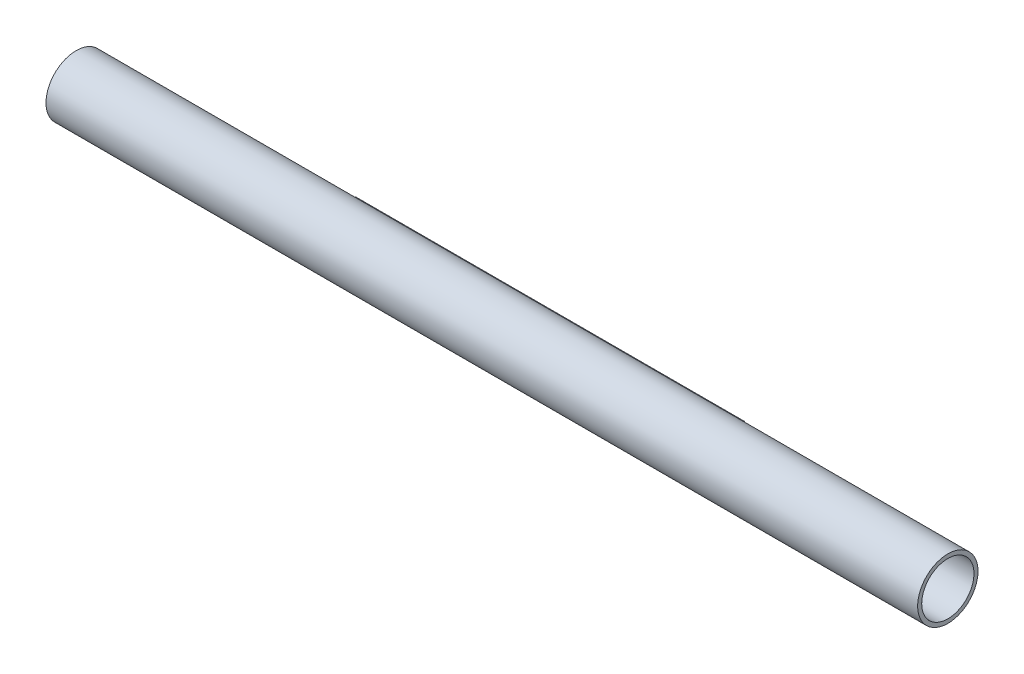
ISO-10303-21;
HEADER;
FILE_DESCRIPTION(('STEP AP214'),'2;1');
FILE_NAME('part.step','',(''),(''),'','','');
FILE_SCHEMA(('AUTOMOTIVE_DESIGN { 1 0 10303 214 1 1 1 1 }'));
ENDSEC;
DATA;
#1=APPLICATION_CONTEXT('core data for automotive mechanical design processes');
#2=APPLICATION_PROTOCOL_DEFINITION('international standard','automotive_design',2000,#1);
#3=PRODUCT_CONTEXT('',#1,'mechanical');
#4=PRODUCT('Part','Part','',(#3));
#5=PRODUCT_RELATED_PRODUCT_CATEGORY('part','',(#4));
#6=PRODUCT_DEFINITION_FORMATION('','',#4);
#7=PRODUCT_DEFINITION_CONTEXT('part definition',#1,'design');
#8=PRODUCT_DEFINITION('design','',#6,#7);
#9=PRODUCT_DEFINITION_SHAPE('','',#8);
#10=(LENGTH_UNIT() NAMED_UNIT(*) SI_UNIT(.MILLI.,.METRE.));
#11=(NAMED_UNIT(*) PLANE_ANGLE_UNIT() SI_UNIT($,.RADIAN.));
#12=(NAMED_UNIT(*) SI_UNIT($,.STERADIAN.) SOLID_ANGLE_UNIT());
#13=UNCERTAINTY_MEASURE_WITH_UNIT(LENGTH_MEASURE(1.E-05),#10,'distance_accuracy_value','');
#14=(GEOMETRIC_REPRESENTATION_CONTEXT(3) GLOBAL_UNCERTAINTY_ASSIGNED_CONTEXT((#13)) GLOBAL_UNIT_ASSIGNED_CONTEXT((#10,
#11,#12)) REPRESENTATION_CONTEXT('',''));
#15=CARTESIAN_POINT('',(0.,0.,0.));
#16=DIRECTION('',(0.,0.,1.));
#17=DIRECTION('',(1.,0.,0.));
#18=AXIS2_PLACEMENT_3D('',#15,#16,#17);
#19=CARTESIAN_POINT('',(-491.49,0.,0.));
#20=DIRECTION('',(1.,0.,0.));
#21=DIRECTION('',(0.,0.,-1.));
#22=AXIS2_PLACEMENT_3D('',#19,#20,#21);
#23=PLANE('',#22);
#24=CARTESIAN_POINT('',(-491.49,0.,0.));
#25=DIRECTION('',(-1.,0.,0.));
#26=DIRECTION('',(0.,0.,1.));
#27=AXIS2_PLACEMENT_3D('',#24,#25,#26);
#28=CIRCLE('',#27,38.1);
#29=CARTESIAN_POINT('',(-491.49,6.35,-37.5671066226826));
#30=VERTEX_POINT('',#29);
#31=CARTESIAN_POINT('',(-491.49,-6.35,-37.5671066226826));
#32=VERTEX_POINT('',#31);
#33=EDGE_CURVE('E91',#30,#32,#28,.T.);
#34=ORIENTED_EDGE('',*,*,#33,.F.);
#35=DIRECTION('',(0.,0.,-1.));
#36=VECTOR('',#35,1.);
#37=CARTESIAN_POINT('',(-491.49,6.35,0.));
#38=LINE('',#37,#36);
#39=CARTESIAN_POINT('',(-491.49,6.35,-48.26));
#40=VERTEX_POINT('',#39);
#41=EDGE_CURVE('E65',#30,#40,#38,.T.);
#42=ORIENTED_EDGE('',*,*,#41,.T.);
#43=DIRECTION('',(0.,1.,0.));
#44=VECTOR('',#43,1.);
#45=CARTESIAN_POINT('',(-491.49,0.,-48.26));
#46=LINE('',#45,#44);
#47=CARTESIAN_POINT('',(-491.49,-6.35,-48.26));
#48=VERTEX_POINT('',#47);
#49=EDGE_CURVE('E110',#48,#40,#46,.T.);
#50=ORIENTED_EDGE('',*,*,#49,.F.);
#51=DIRECTION('',(0.,0.,-1.));
#52=VECTOR('',#51,1.);
#53=CARTESIAN_POINT('',(-491.49,-6.35,0.));
#54=LINE('',#53,#52);
#55=EDGE_CURVE('E98',#32,#48,#54,.T.);
#56=ORIENTED_EDGE('',*,*,#55,.F.);
#57=EDGE_LOOP('',(#34,#42,#50,#56));
#58=FACE_BOUND('',#57,.T.);
#59=ADVANCED_FACE('F45',(#58),#23,.F.);
#60=CARTESIAN_POINT('',(-491.49,0.,0.));
#61=DIRECTION('',(1.,0.,0.));
#62=DIRECTION('',(0.,0.,-1.));
#63=AXIS2_PLACEMENT_3D('',#60,#61,#62);
#64=CYLINDRICAL_SURFACE('',#63,38.1);
#65=DIRECTION('',(1.,0.,0.));
#66=VECTOR('',#65,1.);
#67=CARTESIAN_POINT('',(-491.49,-6.35,-37.5671066226826));
#68=LINE('',#67,#66);
#69=CARTESIAN_POINT('',(0.,-6.35,-37.5671066226826));
#70=VERTEX_POINT('',#69);
#71=EDGE_CURVE('E49',#32,#70,#68,.T.);
#72=ORIENTED_EDGE('',*,*,#71,.T.);
#73=CARTESIAN_POINT('',(0.,0.,0.));
#74=DIRECTION('',(1.,0.,0.));
#75=DIRECTION('',(0.,0.,-1.));
#76=AXIS2_PLACEMENT_3D('',#73,#74,#75);
#77=CIRCLE('',#76,38.1);
#78=CARTESIAN_POINT('',(0.,6.35,-37.5671066226826));
#79=VERTEX_POINT('',#78);
#80=EDGE_CURVE('E11',#70,#79,#77,.T.);
#81=ORIENTED_EDGE('',*,*,#80,.T.);
#82=DIRECTION('',(1.,0.,0.));
#83=VECTOR('',#82,1.);
#84=CARTESIAN_POINT('',(-491.49,6.35,-37.5671066226826));
#85=LINE('',#84,#83);
#86=EDGE_CURVE('E56',#30,#79,#85,.T.);
#87=ORIENTED_EDGE('',*,*,#86,.F.);
#88=ORIENTED_EDGE('',*,*,#33,.T.);
#89=EDGE_LOOP('',(#72,#81,#87,#88));
#90=FACE_BOUND('',#89,.T.);
#91=CARTESIAN_POINT('',(304.8,0.,0.));
#92=DIRECTION('',(1.,0.,0.));
#93=DIRECTION('',(0.,0.,-1.));
#94=AXIS2_PLACEMENT_3D('',#91,#92,#93);
#95=CIRCLE('',#94,38.1);
#96=CARTESIAN_POINT('',(304.8,0.,-38.1));
#97=VERTEX_POINT('',#96);
#98=EDGE_CURVE('E122',#97,#97,#95,.T.);
#99=ORIENTED_EDGE('',*,*,#98,.F.);
#100=EDGE_LOOP('',(#99));
#101=FACE_BOUND('',#100,.T.);
#102=CARTESIAN_POINT('',(-796.29,0.,0.));
#103=DIRECTION('',(-1.,0.,0.));
#104=DIRECTION('',(0.,0.,1.));
#105=AXIS2_PLACEMENT_3D('',#102,#103,#104);
#106=CIRCLE('',#105,38.1);
#107=CARTESIAN_POINT('',(-796.29,0.,38.1));
#108=VERTEX_POINT('',#107);
#109=EDGE_CURVE('E100',#108,#108,#106,.T.);
#110=ORIENTED_EDGE('',*,*,#109,.F.);
#111=EDGE_LOOP('',(#110));
#112=FACE_BOUND('',#111,.T.);
#113=ADVANCED_FACE('F47',(#90,#101,#112),#64,.T.);
#114=CARTESIAN_POINT('',(-491.49,6.35,0.));
#115=DIRECTION('',(0.,-1.,0.));
#116=DIRECTION('',(0.,0.,-1.));
#117=AXIS2_PLACEMENT_3D('',#114,#115,#116);
#118=PLANE('',#117);
#119=DIRECTION('',(0.,0.,-1.));
#120=VECTOR('',#119,1.);
#121=CARTESIAN_POINT('',(0.,6.35,0.));
#122=LINE('',#121,#120);
#123=CARTESIAN_POINT('',(0.,6.35,-48.26));
#124=VERTEX_POINT('',#123);
#125=EDGE_CURVE('E126',#79,#124,#122,.T.);
#126=ORIENTED_EDGE('',*,*,#125,.T.);
#127=DIRECTION('',(1.,0.,0.));
#128=VECTOR('',#127,1.);
#129=CARTESIAN_POINT('',(-491.49,6.35,-48.26));
#130=LINE('',#129,#128);
#131=EDGE_CURVE('E85',#40,#124,#130,.T.);
#132=ORIENTED_EDGE('',*,*,#131,.F.);
#133=ORIENTED_EDGE('',*,*,#41,.F.);
#134=ORIENTED_EDGE('',*,*,#86,.T.);
#135=EDGE_LOOP('',(#126,#132,#133,#134));
#136=FACE_BOUND('',#135,.T.);
#137=ADVANCED_FACE('F108',(#136),#118,.F.);
#138=CARTESIAN_POINT('',(-491.49,0.,-48.26));
#139=DIRECTION('',(0.,0.,-1.));
#140=DIRECTION('',(-1.,0.,0.));
#141=AXIS2_PLACEMENT_3D('',#138,#139,#140);
#142=PLANE('',#141);
#143=DIRECTION('',(0.,1.,0.));
#144=VECTOR('',#143,1.);
#145=CARTESIAN_POINT('',(0.,0.,-48.26));
#146=LINE('',#145,#144);
#147=CARTESIAN_POINT('',(0.,-6.35,-48.26));
#148=VERTEX_POINT('',#147);
#149=EDGE_CURVE('E121',#148,#124,#146,.T.);
#150=ORIENTED_EDGE('',*,*,#149,.F.);
#151=DIRECTION('',(1.,0.,0.));
#152=VECTOR('',#151,1.);
#153=CARTESIAN_POINT('',(-491.49,-6.35,-48.26));
#154=LINE('',#153,#152);
#155=EDGE_CURVE('E80',#48,#148,#154,.T.);
#156=ORIENTED_EDGE('',*,*,#155,.F.);
#157=ORIENTED_EDGE('',*,*,#49,.T.);
#158=ORIENTED_EDGE('',*,*,#131,.T.);
#159=EDGE_LOOP('',(#150,#156,#157,#158));
#160=FACE_BOUND('',#159,.T.);
#161=ADVANCED_FACE('F167',(#160),#142,.T.);
#162=CARTESIAN_POINT('',(-491.49,-6.35,0.));
#163=DIRECTION('',(0.,-1.,0.));
#164=DIRECTION('',(0.,0.,-1.));
#165=AXIS2_PLACEMENT_3D('',#162,#163,#164);
#166=PLANE('',#165);
#167=DIRECTION('',(0.,0.,-1.));
#168=VECTOR('',#167,1.);
#169=CARTESIAN_POINT('',(0.,-6.35,0.));
#170=LINE('',#169,#168);
#171=EDGE_CURVE('E117',#70,#148,#170,.T.);
#172=ORIENTED_EDGE('',*,*,#171,.F.);
#173=ORIENTED_EDGE('',*,*,#71,.F.);
#174=ORIENTED_EDGE('',*,*,#55,.T.);
#175=ORIENTED_EDGE('',*,*,#155,.T.);
#176=EDGE_LOOP('',(#172,#173,#174,#175));
#177=FACE_BOUND('',#176,.T.);
#178=ADVANCED_FACE('F176',(#177),#166,.T.);
#179=CARTESIAN_POINT('',(0.,0.,0.));
#180=DIRECTION('',(1.,0.,0.));
#181=DIRECTION('',(0.,0.,-1.));
#182=AXIS2_PLACEMENT_3D('',#179,#180,#181);
#183=PLANE('',#182);
#184=ORIENTED_EDGE('',*,*,#80,.F.);
#185=ORIENTED_EDGE('',*,*,#171,.T.);
#186=ORIENTED_EDGE('',*,*,#149,.T.);
#187=ORIENTED_EDGE('',*,*,#125,.F.);
#188=EDGE_LOOP('',(#184,#185,#186,#187));
#189=FACE_BOUND('',#188,.T.);
#190=ADVANCED_FACE('F174',(#189),#183,.T.);
#191=CARTESIAN_POINT('',(304.8,0.,0.));
#192=DIRECTION('',(1.,0.,0.));
#193=DIRECTION('',(0.,0.,-1.));
#194=AXIS2_PLACEMENT_3D('',#191,#192,#193);
#195=PLANE('',#194);
#196=CARTESIAN_POINT('',(304.8,0.,0.));
#197=DIRECTION('',(-1.,0.,0.));
#198=DIRECTION('',(0.,0.,1.));
#199=AXIS2_PLACEMENT_3D('',#196,#197,#198);
#200=CIRCLE('',#199,33.02);
#201=CARTESIAN_POINT('',(304.8,0.,33.02));
#202=VERTEX_POINT('',#201);
#203=EDGE_CURVE('E101',#202,#202,#200,.T.);
#204=ORIENTED_EDGE('',*,*,#203,.T.);
#205=EDGE_LOOP('',(#204));
#206=FACE_BOUND('',#205,.T.);
#207=ORIENTED_EDGE('',*,*,#98,.T.);
#208=EDGE_LOOP('',(#207));
#209=FACE_BOUND('',#208,.T.);
#210=ADVANCED_FACE('F147',(#206,#209),#195,.T.);
#211=CARTESIAN_POINT('',(-796.29,0.,0.));
#212=DIRECTION('',(-1.,0.,0.));
#213=DIRECTION('',(0.,0.,1.));
#214=AXIS2_PLACEMENT_3D('',#211,#212,#213);
#215=PLANE('',#214);
#216=CARTESIAN_POINT('',(-796.29,0.,0.));
#217=DIRECTION('',(-1.,0.,0.));
#218=DIRECTION('',(0.,0.,1.));
#219=AXIS2_PLACEMENT_3D('',#216,#217,#218);
#220=CIRCLE('',#219,33.02);
#221=CARTESIAN_POINT('',(-796.29,0.,33.02));
#222=VERTEX_POINT('',#221);
#223=EDGE_CURVE('E139',#222,#222,#220,.T.);
#224=ORIENTED_EDGE('',*,*,#223,.F.);
#225=EDGE_LOOP('',(#224));
#226=FACE_BOUND('',#225,.T.);
#227=ORIENTED_EDGE('',*,*,#109,.T.);
#228=EDGE_LOOP('',(#227));
#229=FACE_BOUND('',#228,.T.);
#230=ADVANCED_FACE('F153',(#226,#229),#215,.T.);
#231=CARTESIAN_POINT('',(304.8,0.,0.));
#232=DIRECTION('',(-1.,0.,0.));
#233=DIRECTION('',(0.,0.,1.));
#234=AXIS2_PLACEMENT_3D('',#231,#232,#233);
#235=CYLINDRICAL_SURFACE('',#234,33.02);
#236=ORIENTED_EDGE('',*,*,#203,.F.);
#237=EDGE_LOOP('',(#236));
#238=FACE_BOUND('',#237,.T.);
#239=ORIENTED_EDGE('',*,*,#223,.T.);
#240=EDGE_LOOP('',(#239));
#241=FACE_BOUND('',#240,.T.);
#242=ADVANCED_FACE('F150',(#238,#241),#235,.F.);
#243=CLOSED_SHELL('',(#59,#113,#137,#161,#178,#190,#210,#230,#242));
#244=MANIFOLD_SOLID_BREP('B2',#243);
#245=ADVANCED_BREP_SHAPE_REPRESENTATION('',(#18,#244),#14);
#246=SHAPE_DEFINITION_REPRESENTATION(#9,#245);
ENDSEC;
END-ISO-10303-21;
